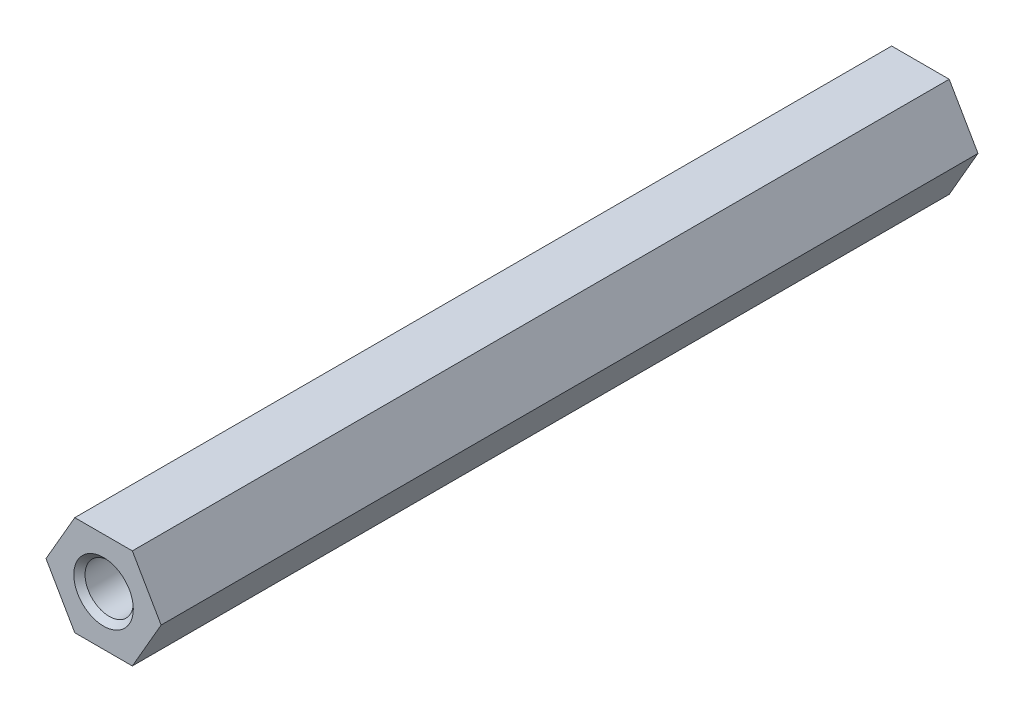
ISO-10303-21;
HEADER;
FILE_DESCRIPTION(('STEP AP214'),'2;1');
FILE_NAME('part.step','',(''),(''),'','','');
FILE_SCHEMA(('AUTOMOTIVE_DESIGN { 1 0 10303 214 1 1 1 1 }'));
ENDSEC;
DATA;
#1=APPLICATION_CONTEXT('core data for automotive mechanical design processes');
#2=APPLICATION_PROTOCOL_DEFINITION('international standard','automotive_design',2000,#1);
#3=PRODUCT_CONTEXT('',#1,'mechanical');
#4=PRODUCT('Part','Part','',(#3));
#5=PRODUCT_RELATED_PRODUCT_CATEGORY('part','',(#4));
#6=PRODUCT_DEFINITION_FORMATION('','',#4);
#7=PRODUCT_DEFINITION_CONTEXT('part definition',#1,'design');
#8=PRODUCT_DEFINITION('design','',#6,#7);
#9=PRODUCT_DEFINITION_SHAPE('','',#8);
#10=(LENGTH_UNIT() NAMED_UNIT(*) SI_UNIT(.MILLI.,.METRE.));
#11=(NAMED_UNIT(*) PLANE_ANGLE_UNIT() SI_UNIT($,.RADIAN.));
#12=(NAMED_UNIT(*) SI_UNIT($,.STERADIAN.) SOLID_ANGLE_UNIT());
#13=UNCERTAINTY_MEASURE_WITH_UNIT(LENGTH_MEASURE(1.E-05),#10,'distance_accuracy_value','');
#14=(GEOMETRIC_REPRESENTATION_CONTEXT(3) GLOBAL_UNCERTAINTY_ASSIGNED_CONTEXT((#13)) GLOBAL_UNIT_ASSIGNED_CONTEXT((#10,
#11,#12)) REPRESENTATION_CONTEXT('',''));
#15=CARTESIAN_POINT('',(0.,0.,0.));
#16=DIRECTION('',(0.,0.,1.));
#17=DIRECTION('',(1.,0.,0.));
#18=AXIS2_PLACEMENT_3D('',#15,#16,#17);
#19=CARTESIAN_POINT('',(1.78978583448784,-3.1,0.));
#20=DIRECTION('',(0.866025403784439,-0.5,0.));
#21=DIRECTION('',(0.5,0.866025403784439,0.));
#22=AXIS2_PLACEMENT_3D('',#19,#20,#21);
#23=PLANE('',#22);
#24=DIRECTION('',(0.5,0.866025403784439,0.));
#25=VECTOR('',#24,1.);
#26=CARTESIAN_POINT('',(1.78978583448784,-3.1,50.8));
#27=LINE('',#26,#25);
#28=CARTESIAN_POINT('',(1.78978583448784,-3.1,50.8));
#29=VERTEX_POINT('',#28);
#30=CARTESIAN_POINT('',(3.57957166897568,0.,50.8));
#31=VERTEX_POINT('',#30);
#32=EDGE_CURVE('E80',#29,#31,#27,.T.);
#33=ORIENTED_EDGE('',*,*,#32,.F.);
#34=DIRECTION('',(0.,0.,-1.));
#35=VECTOR('',#34,1.);
#36=CARTESIAN_POINT('',(1.78978583448784,-3.1,0.));
#37=LINE('',#36,#35);
#38=CARTESIAN_POINT('',(1.78978583448784,-3.1,0.));
#39=VERTEX_POINT('',#38);
#40=EDGE_CURVE('E68',#39,#29,#37,.F.);
#41=ORIENTED_EDGE('',*,*,#40,.F.);
#42=DIRECTION('',(0.5,0.866025403784439,0.));
#43=VECTOR('',#42,1.);
#44=CARTESIAN_POINT('',(1.78978583448784,-3.1,0.));
#45=LINE('',#44,#43);
#46=CARTESIAN_POINT('',(3.57957166897568,0.,0.));
#47=VERTEX_POINT('',#46);
#48=EDGE_CURVE('E122',#39,#47,#45,.T.);
#49=ORIENTED_EDGE('',*,*,#48,.T.);
#50=DIRECTION('',(0.,0.,1.));
#51=VECTOR('',#50,1.);
#52=CARTESIAN_POINT('',(3.57957166897568,0.,0.));
#53=LINE('',#52,#51);
#54=EDGE_CURVE('E84',#31,#47,#53,.F.);
#55=ORIENTED_EDGE('',*,*,#54,.F.);
#56=EDGE_LOOP('',(#33,#41,#49,#55));
#57=FACE_BOUND('',#56,.T.);
#58=ADVANCED_FACE('F15',(#57),#23,.T.);
#59=CARTESIAN_POINT('',(3.57957166897568,0.,0.));
#60=DIRECTION('',(0.866025403784438,0.5,0.));
#61=DIRECTION('',(-0.5,0.866025403784438,0.));
#62=AXIS2_PLACEMENT_3D('',#59,#60,#61);
#63=PLANE('',#62);
#64=DIRECTION('',(-0.5,0.866025403784439,0.));
#65=VECTOR('',#64,1.);
#66=CARTESIAN_POINT('',(3.57957166897568,0.,50.8));
#67=LINE('',#66,#65);
#68=CARTESIAN_POINT('',(1.78978583448784,3.1,50.8));
#69=VERTEX_POINT('',#68);
#70=EDGE_CURVE('E86',#31,#69,#67,.T.);
#71=ORIENTED_EDGE('',*,*,#70,.F.);
#72=ORIENTED_EDGE('',*,*,#54,.T.);
#73=DIRECTION('',(-0.5,0.866025403784439,0.));
#74=VECTOR('',#73,1.);
#75=CARTESIAN_POINT('',(3.57957166897568,0.,0.));
#76=LINE('',#75,#74);
#77=CARTESIAN_POINT('',(1.78978583448784,3.1,0.));
#78=VERTEX_POINT('',#77);
#79=EDGE_CURVE('E119',#47,#78,#76,.T.);
#80=ORIENTED_EDGE('',*,*,#79,.T.);
#81=DIRECTION('',(0.,0.,1.));
#82=VECTOR('',#81,1.);
#83=CARTESIAN_POINT('',(1.78978583448784,3.1,0.));
#84=LINE('',#83,#82);
#85=EDGE_CURVE('E96',#69,#78,#84,.F.);
#86=ORIENTED_EDGE('',*,*,#85,.F.);
#87=EDGE_LOOP('',(#71,#72,#80,#86));
#88=FACE_BOUND('',#87,.T.);
#89=ADVANCED_FACE('F225',(#88),#63,.T.);
#90=CARTESIAN_POINT('',(1.78978583448784,3.1,0.));
#91=DIRECTION('',(0.,1.,0.));
#92=DIRECTION('',(0.,0.,1.));
#93=AXIS2_PLACEMENT_3D('',#90,#91,#92);
#94=PLANE('',#93);
#95=DIRECTION('',(1.,0.,0.));
#96=VECTOR('',#95,1.);
#97=CARTESIAN_POINT('',(0.,3.1,50.8));
#98=LINE('',#97,#96);
#99=CARTESIAN_POINT('',(-1.78978583448784,3.1,50.8));
#100=VERTEX_POINT('',#99);
#101=EDGE_CURVE('E88',#69,#100,#98,.F.);
#102=ORIENTED_EDGE('',*,*,#101,.F.);
#103=ORIENTED_EDGE('',*,*,#85,.T.);
#104=DIRECTION('',(1.,0.,0.));
#105=VECTOR('',#104,1.);
#106=CARTESIAN_POINT('',(0.,3.1,0.));
#107=LINE('',#106,#105);
#108=CARTESIAN_POINT('',(-1.78978583448784,3.1,0.));
#109=VERTEX_POINT('',#108);
#110=EDGE_CURVE('E116',#78,#109,#107,.F.);
#111=ORIENTED_EDGE('',*,*,#110,.T.);
#112=DIRECTION('',(0.,0.,1.));
#113=VECTOR('',#112,1.);
#114=CARTESIAN_POINT('',(-1.78978583448784,3.1,0.));
#115=LINE('',#114,#113);
#116=EDGE_CURVE('E94',#100,#109,#115,.F.);
#117=ORIENTED_EDGE('',*,*,#116,.F.);
#118=EDGE_LOOP('',(#102,#103,#111,#117));
#119=FACE_BOUND('',#118,.T.);
#120=ADVANCED_FACE('F132',(#119),#94,.T.);
#121=CARTESIAN_POINT('',(-1.78978583448784,3.1,0.));
#122=DIRECTION('',(-0.866025403784439,0.5,0.));
#123=DIRECTION('',(-0.5,-0.866025403784439,0.));
#124=AXIS2_PLACEMENT_3D('',#121,#122,#123);
#125=PLANE('',#124);
#126=DIRECTION('',(-0.5,-0.866025403784439,0.));
#127=VECTOR('',#126,1.);
#128=CARTESIAN_POINT('',(-1.78978583448784,3.1,50.8));
#129=LINE('',#128,#127);
#130=CARTESIAN_POINT('',(-3.57957166897568,0.,50.8));
#131=VERTEX_POINT('',#130);
#132=EDGE_CURVE('E125',#100,#131,#129,.T.);
#133=ORIENTED_EDGE('',*,*,#132,.F.);
#134=ORIENTED_EDGE('',*,*,#116,.T.);
#135=DIRECTION('',(-0.5,-0.866025403784439,0.));
#136=VECTOR('',#135,1.);
#137=CARTESIAN_POINT('',(-1.78978583448784,3.1,0.));
#138=LINE('',#137,#136);
#139=CARTESIAN_POINT('',(-3.57957166897568,0.,0.));
#140=VERTEX_POINT('',#139);
#141=EDGE_CURVE('E109',#109,#140,#138,.T.);
#142=ORIENTED_EDGE('',*,*,#141,.T.);
#143=DIRECTION('',(0.,0.,1.));
#144=VECTOR('',#143,1.);
#145=CARTESIAN_POINT('',(-3.57957166897568,0.,0.));
#146=LINE('',#145,#144);
#147=EDGE_CURVE('E76',#131,#140,#146,.F.);
#148=ORIENTED_EDGE('',*,*,#147,.F.);
#149=EDGE_LOOP('',(#133,#134,#142,#148));
#150=FACE_BOUND('',#149,.T.);
#151=ADVANCED_FACE('F136',(#150),#125,.T.);
#152=CARTESIAN_POINT('',(-3.57957166897568,0.,0.));
#153=DIRECTION('',(-0.866025403784439,-0.5,0.));
#154=DIRECTION('',(0.5,-0.866025403784439,0.));
#155=AXIS2_PLACEMENT_3D('',#152,#153,#154);
#156=PLANE('',#155);
#157=DIRECTION('',(0.5,-0.866025403784439,0.));
#158=VECTOR('',#157,1.);
#159=CARTESIAN_POINT('',(-3.57957166897568,0.,50.8));
#160=LINE('',#159,#158);
#161=CARTESIAN_POINT('',(-1.78978583448784,-3.1,50.8));
#162=VERTEX_POINT('',#161);
#163=EDGE_CURVE('E82',#131,#162,#160,.T.);
#164=ORIENTED_EDGE('',*,*,#163,.F.);
#165=ORIENTED_EDGE('',*,*,#147,.T.);
#166=DIRECTION('',(0.5,-0.866025403784439,0.));
#167=VECTOR('',#166,1.);
#168=CARTESIAN_POINT('',(-3.57957166897568,0.,0.));
#169=LINE('',#168,#167);
#170=CARTESIAN_POINT('',(-1.78978583448784,-3.1,0.));
#171=VERTEX_POINT('',#170);
#172=EDGE_CURVE('E107',#140,#171,#169,.T.);
#173=ORIENTED_EDGE('',*,*,#172,.T.);
#174=DIRECTION('',(0.,0.,-1.));
#175=VECTOR('',#174,1.);
#176=CARTESIAN_POINT('',(-1.78978583448784,-3.1,0.));
#177=LINE('',#176,#175);
#178=EDGE_CURVE('E33',#162,#171,#177,.T.);
#179=ORIENTED_EDGE('',*,*,#178,.F.);
#180=EDGE_LOOP('',(#164,#165,#173,#179));
#181=FACE_BOUND('',#180,.T.);
#182=ADVANCED_FACE('F138',(#181),#156,.T.);
#183=CARTESIAN_POINT('',(-1.78978583448784,-3.1,0.));
#184=DIRECTION('',(0.,-1.,0.));
#185=DIRECTION('',(0.,0.,-1.));
#186=AXIS2_PLACEMENT_3D('',#183,#184,#185);
#187=PLANE('',#186);
#188=DIRECTION('',(1.,0.,0.));
#189=VECTOR('',#188,1.);
#190=CARTESIAN_POINT('',(0.,-3.1,50.8));
#191=LINE('',#190,#189);
#192=EDGE_CURVE('E71',#162,#29,#191,.T.);
#193=ORIENTED_EDGE('',*,*,#192,.F.);
#194=ORIENTED_EDGE('',*,*,#178,.T.);
#195=DIRECTION('',(1.,0.,0.));
#196=VECTOR('',#195,1.);
#197=CARTESIAN_POINT('',(0.,-3.1,0.));
#198=LINE('',#197,#196);
#199=EDGE_CURVE('E72',#171,#39,#198,.T.);
#200=ORIENTED_EDGE('',*,*,#199,.T.);
#201=ORIENTED_EDGE('',*,*,#40,.T.);
#202=EDGE_LOOP('',(#193,#194,#200,#201));
#203=FACE_BOUND('',#202,.T.);
#204=ADVANCED_FACE('F70',(#203),#187,.T.);
#205=CARTESIAN_POINT('',(0.,0.,50.8));
#206=DIRECTION('',(0.,0.,1.));
#207=DIRECTION('',(1.,0.,0.));
#208=AXIS2_PLACEMENT_3D('',#205,#206,#207);
#209=PLANE('',#208);
#210=CARTESIAN_POINT('',(0.,0.,50.8000000000948));
#211=DIRECTION('',(0.,0.,1.));
#212=DIRECTION('',(1.,0.,0.));
#213=AXIS2_PLACEMENT_3D('',#210,#211,#212);
#214=CIRCLE('',#213,1.84999999993352);
#215=CARTESIAN_POINT('',(1.84999999993353,0.,50.8000000000948));
#216=VERTEX_POINT('',#215);
#217=EDGE_CURVE('E18',#216,#216,#214,.F.);
#218=ORIENTED_EDGE('',*,*,#217,.T.);
#219=EDGE_LOOP('',(#218));
#220=FACE_BOUND('',#219,.T.);
#221=ORIENTED_EDGE('',*,*,#132,.T.);
#222=ORIENTED_EDGE('',*,*,#163,.T.);
#223=ORIENTED_EDGE('',*,*,#192,.T.);
#224=ORIENTED_EDGE('',*,*,#32,.T.);
#225=ORIENTED_EDGE('',*,*,#70,.T.);
#226=ORIENTED_EDGE('',*,*,#101,.T.);
#227=EDGE_LOOP('',(#221,#222,#223,#224,#225,#226));
#228=FACE_BOUND('',#227,.T.);
#229=ADVANCED_FACE('F79',(#220,#228),#209,.T.);
#230=CARTESIAN_POINT('',(0.,0.,0.));
#231=DIRECTION('',(0.,0.,1.));
#232=DIRECTION('',(1.,0.,0.));
#233=AXIS2_PLACEMENT_3D('',#230,#231,#232);
#234=PLANE('',#233);
#235=CARTESIAN_POINT('',(0.,0.,0.));
#236=DIRECTION('',(0.,0.,-1.));
#237=DIRECTION('',(-1.,0.,0.));
#238=AXIS2_PLACEMENT_3D('',#235,#236,#237);
#239=CIRCLE('',#238,1.84999999993352);
#240=CARTESIAN_POINT('',(-1.84999999993352,0.,0.));
#241=VERTEX_POINT('',#240);
#242=EDGE_CURVE('E98',#241,#241,#239,.F.);
#243=ORIENTED_EDGE('',*,*,#242,.T.);
#244=EDGE_LOOP('',(#243));
#245=FACE_BOUND('',#244,.T.);
#246=ORIENTED_EDGE('',*,*,#172,.F.);
#247=ORIENTED_EDGE('',*,*,#141,.F.);
#248=ORIENTED_EDGE('',*,*,#110,.F.);
#249=ORIENTED_EDGE('',*,*,#79,.F.);
#250=ORIENTED_EDGE('',*,*,#48,.F.);
#251=ORIENTED_EDGE('',*,*,#199,.F.);
#252=EDGE_LOOP('',(#246,#247,#248,#249,#250,#251));
#253=FACE_BOUND('',#252,.T.);
#254=ADVANCED_FACE('F164',(#245,#253),#234,.F.);
#255=CARTESIAN_POINT('',(0.,0.,50.8000000000379));
#256=DIRECTION('',(0.,0.,1.));
#257=DIRECTION('',(1.,0.,0.));
#258=AXIS2_PLACEMENT_3D('',#255,#256,#257);
#259=CONICAL_SURFACE('',#258,1.84999999987667,0.785398163397448);
#260=CARTESIAN_POINT('',(0.,0.,50.45));
#261=DIRECTION('',(0.,0.,-1.));
#262=DIRECTION('',(-1.,0.,0.));
#263=AXIS2_PLACEMENT_3D('',#260,#261,#262);
#264=CIRCLE('',#263,1.5);
#265=CARTESIAN_POINT('',(-1.5,0.,50.45));
#266=VERTEX_POINT('',#265);
#267=EDGE_CURVE('E24',#266,#266,#264,.T.);
#268=ORIENTED_EDGE('',*,*,#267,.T.);
#269=EDGE_LOOP('',(#268));
#270=FACE_BOUND('',#269,.T.);
#271=ORIENTED_EDGE('',*,*,#217,.F.);
#272=EDGE_LOOP('',(#271));
#273=FACE_BOUND('',#272,.T.);
#274=ADVANCED_FACE('F156',(#270,#273),#259,.F.);
#275=CARTESIAN_POINT('',(0.,0.,5.6843418860808E-11));
#276=DIRECTION('',(0.,0.,-1.));
#277=DIRECTION('',(-1.,0.,0.));
#278=AXIS2_PLACEMENT_3D('',#275,#276,#277);
#279=CONICAL_SURFACE('',#278,1.84999999987667,0.785398163397448);
#280=CARTESIAN_POINT('',(0.,0.,0.350000000000003));
#281=DIRECTION('',(0.,0.,-1.));
#282=DIRECTION('',(-1.,0.,0.));
#283=AXIS2_PLACEMENT_3D('',#280,#281,#282);
#284=CIRCLE('',#283,1.5);
#285=CARTESIAN_POINT('',(-1.5,0.,0.350000000000003));
#286=VERTEX_POINT('',#285);
#287=EDGE_CURVE('E10',#286,#286,#284,.F.);
#288=ORIENTED_EDGE('',*,*,#287,.T.);
#289=EDGE_LOOP('',(#288));
#290=FACE_BOUND('',#289,.T.);
#291=ORIENTED_EDGE('',*,*,#242,.F.);
#292=EDGE_LOOP('',(#291));
#293=FACE_BOUND('',#292,.T.);
#294=ADVANCED_FACE('F150',(#290,#293),#279,.F.);
#295=CARTESIAN_POINT('',(0.,0.,50.8));
#296=DIRECTION('',(0.,0.,-1.));
#297=DIRECTION('',(-1.,0.,0.));
#298=AXIS2_PLACEMENT_3D('',#295,#296,#297);
#299=CYLINDRICAL_SURFACE('',#298,1.5);
#300=ORIENTED_EDGE('',*,*,#287,.F.);
#301=EDGE_LOOP('',(#300));
#302=FACE_BOUND('',#301,.T.);
#303=ORIENTED_EDGE('',*,*,#267,.F.);
#304=EDGE_LOOP('',(#303));
#305=FACE_BOUND('',#304,.T.);
#306=ADVANCED_FACE('F148',(#302,#305),#299,.F.);
#307=CLOSED_SHELL('',(#58,#89,#120,#151,#182,#204,#229,#254,#274,#294,#306));
#308=MANIFOLD_SOLID_BREP('B1',#307);
#309=ADVANCED_BREP_SHAPE_REPRESENTATION('',(#18,#308),#14);
#310=SHAPE_DEFINITION_REPRESENTATION(#9,#309);
ENDSEC;
END-ISO-10303-21;
